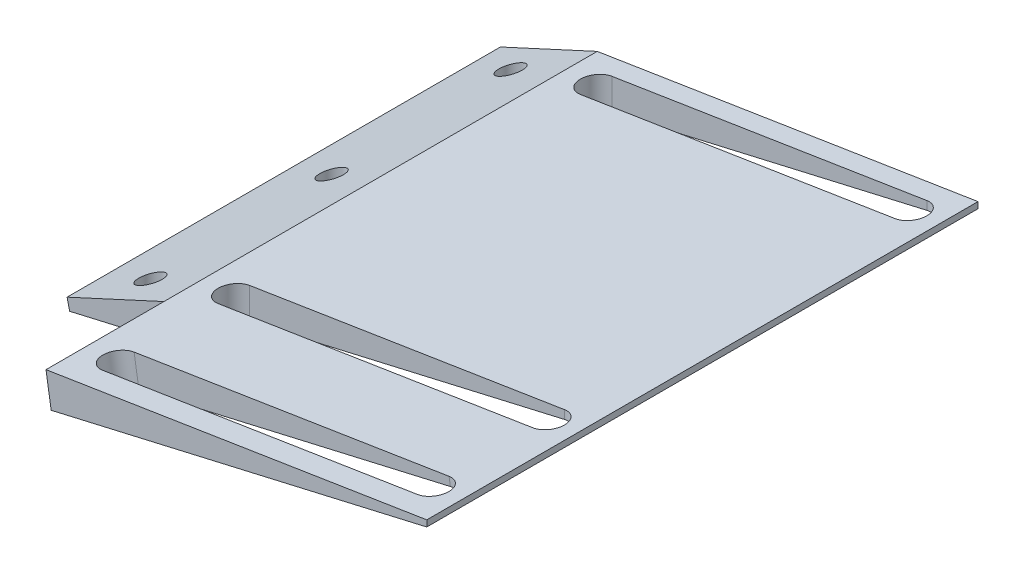
ISO-10303-21;
HEADER;
FILE_DESCRIPTION(('STEP AP214'),'2;1');
FILE_NAME('part.step','',(''),(''),'','','');
FILE_SCHEMA(('AUTOMOTIVE_DESIGN { 1 0 10303 214 1 1 1 1 }'));
ENDSEC;
DATA;
#1=APPLICATION_CONTEXT('core data for automotive mechanical design processes');
#2=APPLICATION_PROTOCOL_DEFINITION('international standard','automotive_design',2000,#1);
#3=PRODUCT_CONTEXT('',#1,'mechanical');
#4=PRODUCT('Part','Part','',(#3));
#5=PRODUCT_RELATED_PRODUCT_CATEGORY('part','',(#4));
#6=PRODUCT_DEFINITION_FORMATION('','',#4);
#7=PRODUCT_DEFINITION_CONTEXT('part definition',#1,'design');
#8=PRODUCT_DEFINITION('design','',#6,#7);
#9=PRODUCT_DEFINITION_SHAPE('','',#8);
#10=(LENGTH_UNIT() NAMED_UNIT(*) SI_UNIT(.MILLI.,.METRE.));
#11=(NAMED_UNIT(*) PLANE_ANGLE_UNIT() SI_UNIT($,.RADIAN.));
#12=(NAMED_UNIT(*) SI_UNIT($,.STERADIAN.) SOLID_ANGLE_UNIT());
#13=UNCERTAINTY_MEASURE_WITH_UNIT(LENGTH_MEASURE(1.E-05),#10,'distance_accuracy_value','');
#14=(GEOMETRIC_REPRESENTATION_CONTEXT(3) GLOBAL_UNCERTAINTY_ASSIGNED_CONTEXT((#13)) GLOBAL_UNIT_ASSIGNED_CONTEXT((#10,
#11,#12)) REPRESENTATION_CONTEXT('',''));
#15=CARTESIAN_POINT('',(0.,0.,0.));
#16=DIRECTION('',(0.,0.,1.));
#17=DIRECTION('',(1.,0.,0.));
#18=AXIS2_PLACEMENT_3D('',#15,#16,#17);
#19=CARTESIAN_POINT('',(0.,0.,110.));
#20=DIRECTION('',(0.156434465040224,-0.987688340595139,0.));
#21=DIRECTION('',(0.987688340595139,0.156434465040224,0.));
#22=AXIS2_PLACEMENT_3D('',#19,#20,#21);
#23=PLANE('',#22);
#24=DIRECTION('',(0.987688340595139,0.156434465040224,0.));
#25=VECTOR('',#24,1.);
#26=CARTESIAN_POINT('',(0.,0.,126.324079107667));
#27=LINE('',#26,#25);
#28=CARTESIAN_POINT('',(-109.820404962566,-17.3938433762093,126.324079107667));
#29=VERTEX_POINT('',#28);
#30=CARTESIAN_POINT('',(-29.8204049625664,-4.72308815024691,126.324079107667));
#31=VERTEX_POINT('',#30);
#32=EDGE_CURVE('E177',#29,#31,#27,.T.);
#33=ORIENTED_EDGE('',*,*,#32,.T.);
#34=CARTESIAN_POINT('',(-29.8204049625664,-4.72308815024691,130.324079107667));
#35=DIRECTION('',(0.156434465040224,-0.987688340595139,0.));
#36=DIRECTION('',(0.987688340595139,0.156434465040224,0.));
#37=AXIS2_PLACEMENT_3D('',#34,#35,#36);
#38=CIRCLE('',#37,4.);
#39=CARTESIAN_POINT('',(-29.8204049625664,-4.72308815024691,134.324079107667));
#40=VERTEX_POINT('',#39);
#41=EDGE_CURVE('E215',#31,#40,#38,.T.);
#42=ORIENTED_EDGE('',*,*,#41,.T.);
#43=DIRECTION('',(-0.987688340595139,-0.156434465040224,0.));
#44=VECTOR('',#43,1.);
#45=CARTESIAN_POINT('',(0.,0.,134.324079107667));
#46=LINE('',#45,#44);
#47=CARTESIAN_POINT('',(-109.820404962566,-17.3938433762093,134.324079107667));
#48=VERTEX_POINT('',#47);
#49=EDGE_CURVE('E211',#40,#48,#46,.T.);
#50=ORIENTED_EDGE('',*,*,#49,.T.);
#51=CARTESIAN_POINT('',(-109.820404962566,-17.3938433762093,130.324079107667));
#52=DIRECTION('',(0.156434465040224,-0.987688340595139,0.));
#53=DIRECTION('',(0.987688340595139,0.156434465040224,0.));
#54=AXIS2_PLACEMENT_3D('',#51,#52,#53);
#55=CIRCLE('',#54,4.00000000000002);
#56=EDGE_CURVE('E207',#48,#29,#55,.T.);
#57=ORIENTED_EDGE('',*,*,#56,.T.);
#58=EDGE_LOOP('',(#33,#42,#50,#57));
#59=FACE_BOUND('',#58,.T.);
#60=DIRECTION('',(0.987688340595139,0.156434465040224,0.));
#61=VECTOR('',#60,1.);
#62=CARTESIAN_POINT('',(0.,0.,5.00000000000002));
#63=LINE('',#62,#61);
#64=CARTESIAN_POINT('',(-109.820404962566,-17.3938433762093,4.99999999999998));
#65=VERTEX_POINT('',#64);
#66=CARTESIAN_POINT('',(-29.8204049625664,-4.72308815024691,5.00000000000001));
#67=VERTEX_POINT('',#66);
#68=EDGE_CURVE('E290',#65,#67,#63,.T.);
#69=ORIENTED_EDGE('',*,*,#68,.T.);
#70=CARTESIAN_POINT('',(-29.8204049625664,-4.7230881502469,8.99999999999998));
#71=DIRECTION('',(0.156434465040224,-0.987688340595139,0.));
#72=DIRECTION('',(0.987688340595139,0.156434465040224,0.));
#73=AXIS2_PLACEMENT_3D('',#70,#71,#72);
#74=ELLIPSE('',#73,4.049860503152,3.99999999999999);
#75=CARTESIAN_POINT('',(-29.8204049625664,-4.72308815024691,13.));
#76=VERTEX_POINT('',#75);
#77=EDGE_CURVE('E302',#67,#76,#74,.T.);
#78=ORIENTED_EDGE('',*,*,#77,.T.);
#79=DIRECTION('',(-0.987688340595139,-0.156434465040224,0.));
#80=VECTOR('',#79,1.);
#81=CARTESIAN_POINT('',(0.,0.,13.));
#82=LINE('',#81,#80);
#83=CARTESIAN_POINT('',(-109.820404962566,-17.3938433762093,13.));
#84=VERTEX_POINT('',#83);
#85=EDGE_CURVE('E298',#76,#84,#82,.T.);
#86=ORIENTED_EDGE('',*,*,#85,.T.);
#87=CARTESIAN_POINT('',(-109.820404962566,-17.3938433762093,8.99999999999997));
#88=DIRECTION('',(0.156434465040224,-0.987688340595139,0.));
#89=DIRECTION('',(0.987688340595139,0.156434465040224,0.));
#90=AXIS2_PLACEMENT_3D('',#87,#88,#89);
#91=ELLIPSE('',#90,4.04986050315203,4.00000000000003);
#92=EDGE_CURVE('E294',#84,#65,#91,.T.);
#93=ORIENTED_EDGE('',*,*,#92,.T.);
#94=EDGE_LOOP('',(#69,#78,#86,#93));
#95=FACE_BOUND('',#94,.T.);
#96=DIRECTION('',(0.987688340595139,0.156434465040224,0.));
#97=VECTOR('',#96,1.);
#98=CARTESIAN_POINT('',(0.,0.,97.));
#99=LINE('',#98,#97);
#100=CARTESIAN_POINT('',(-109.820404962566,-17.3938433762093,97.));
#101=VERTEX_POINT('',#100);
#102=CARTESIAN_POINT('',(-29.8204049625664,-4.72308815024691,97.));
#103=VERTEX_POINT('',#102);
#104=EDGE_CURVE('E274',#101,#103,#99,.T.);
#105=ORIENTED_EDGE('',*,*,#104,.T.);
#106=CARTESIAN_POINT('',(-29.8204049625664,-4.7230881502469,101.));
#107=DIRECTION('',(0.156434465040224,-0.987688340595139,0.));
#108=DIRECTION('',(0.987688340595139,0.156434465040224,0.));
#109=AXIS2_PLACEMENT_3D('',#106,#107,#108);
#110=ELLIPSE('',#109,4.049860503152,3.99999999999999);
#111=CARTESIAN_POINT('',(-29.8204049625664,-4.72308815024691,105.));
#112=VERTEX_POINT('',#111);
#113=EDGE_CURVE('E286',#103,#112,#110,.T.);
#114=ORIENTED_EDGE('',*,*,#113,.T.);
#115=DIRECTION('',(-0.987688340595139,-0.156434465040224,0.));
#116=VECTOR('',#115,1.);
#117=CARTESIAN_POINT('',(0.,0.,105.));
#118=LINE('',#117,#116);
#119=CARTESIAN_POINT('',(-109.820404962566,-17.3938433762093,105.));
#120=VERTEX_POINT('',#119);
#121=EDGE_CURVE('E282',#112,#120,#118,.T.);
#122=ORIENTED_EDGE('',*,*,#121,.T.);
#123=CARTESIAN_POINT('',(-109.820404962566,-17.3938433762093,101.));
#124=DIRECTION('',(0.156434465040224,-0.987688340595139,0.));
#125=DIRECTION('',(0.987688340595139,0.156434465040224,0.));
#126=AXIS2_PLACEMENT_3D('',#123,#124,#125);
#127=ELLIPSE('',#126,4.04986050315204,4.00000000000003);
#128=EDGE_CURVE('E278',#120,#101,#127,.T.);
#129=ORIENTED_EDGE('',*,*,#128,.T.);
#130=EDGE_LOOP('',(#105,#114,#122,#129));
#131=FACE_BOUND('',#130,.T.);
#132=DIRECTION('',(0.,0.,1.));
#133=VECTOR('',#132,1.);
#134=CARTESIAN_POINT('',(-21.8204049625664,-3.45601262765067,0.));
#135=LINE('',#134,#133);
#136=CARTESIAN_POINT('',(-21.8204049625664,-3.45601262765067,0.));
#137=VERTEX_POINT('',#136);
#138=CARTESIAN_POINT('',(-21.8204049625664,-3.45601262765067,140.));
#139=VERTEX_POINT('',#138);
#140=EDGE_CURVE('E310',#137,#139,#135,.T.);
#141=ORIENTED_EDGE('',*,*,#140,.F.);
#142=DIRECTION('',(-0.987688340595139,-0.156434465040224,0.));
#143=VECTOR('',#142,1.);
#144=CARTESIAN_POINT('',(0.,0.,0.));
#145=LINE('',#144,#143);
#146=CARTESIAN_POINT('',(-118.522600871417,-18.7721358048269,0.));
#147=VERTEX_POINT('',#146);
#148=EDGE_CURVE('E313',#137,#147,#145,.T.);
#149=ORIENTED_EDGE('',*,*,#148,.T.);
#150=DIRECTION('',(0.,0.,-1.));
#151=VECTOR('',#150,1.);
#152=CARTESIAN_POINT('',(-118.522600871417,-18.7721358048269,110.));
#153=LINE('',#152,#151);
#154=CARTESIAN_POINT('',(-118.522600871417,-18.7721358048269,110.045443527415));
#155=VERTEX_POINT('',#154);
#156=EDGE_CURVE('E337',#155,#147,#153,.T.);
#157=ORIENTED_EDGE('',*,*,#156,.F.);
#158=CARTESIAN_POINT('',(-118.522600871417,-18.7721358048269,140.));
#159=VERTEX_POINT('',#158);
#160=EDGE_CURVE('E185',#159,#155,#153,.T.);
#161=ORIENTED_EDGE('',*,*,#160,.F.);
#162=DIRECTION('',(-0.987688340595139,-0.156434465040224,0.));
#163=VECTOR('',#162,1.);
#164=CARTESIAN_POINT('',(-21.8204049625664,-3.45601262765067,140.));
#165=LINE('',#164,#163);
#166=EDGE_CURVE('E225',#139,#159,#165,.T.);
#167=ORIENTED_EDGE('',*,*,#166,.F.);
#168=EDGE_LOOP('',(#141,#149,#157,#161,#167));
#169=FACE_BOUND('',#168,.T.);
#170=ADVANCED_FACE('F39',(#59,#95,#131,#169),#23,.F.);
#171=CARTESIAN_POINT('',(0.,0.,110.));
#172=DIRECTION('',(-0.224951054343859,0.974370064785237,0.));
#173=DIRECTION('',(-0.974370064785237,-0.224951054343859,0.));
#174=AXIS2_PLACEMENT_3D('',#171,#172,#173);
#175=PLANE('',#174);
#176=DIRECTION('',(0.974370064785237,0.224951054343859,0.));
#177=VECTOR('',#176,1.);
#178=CARTESIAN_POINT('',(0.,0.,134.324079107667));
#179=LINE('',#178,#177);
#180=CARTESIAN_POINT('',(-108.604108947823,-25.0732341815868,134.324079107667));
#181=VERTEX_POINT('',#180);
#182=CARTESIAN_POINT('',(-29.4901344656915,-6.80833400014363,134.324079107667));
#183=VERTEX_POINT('',#182);
#184=EDGE_CURVE('E47',#181,#183,#179,.T.);
#185=ORIENTED_EDGE('',*,*,#184,.T.);
#186=CARTESIAN_POINT('',(-29.4901344656915,-6.80833400014362,130.324079107667));
#187=DIRECTION('',(-0.224951054343859,0.974370064785237,0.));
#188=DIRECTION('',(0.974370064785237,0.224951054343859,0.));
#189=AXIS2_PLACEMENT_3D('',#186,#187,#188);
#190=ELLIPSE('',#189,4.00976759232469,4.);
#191=CARTESIAN_POINT('',(-29.4901344656915,-6.80833400014363,126.324079107667));
#192=VERTEX_POINT('',#191);
#193=EDGE_CURVE('E11',#183,#192,#190,.T.);
#194=ORIENTED_EDGE('',*,*,#193,.T.);
#195=DIRECTION('',(-0.974370064785237,-0.224951054343859,0.));
#196=VECTOR('',#195,1.);
#197=CARTESIAN_POINT('',(0.,0.,126.324079107667));
#198=LINE('',#197,#196);
#199=CARTESIAN_POINT('',(-108.604108947823,-25.0732341815868,126.324079107667));
#200=VERTEX_POINT('',#199);
#201=EDGE_CURVE('E386',#192,#200,#198,.T.);
#202=ORIENTED_EDGE('',*,*,#201,.T.);
#203=CARTESIAN_POINT('',(-108.604108947823,-25.0732341815868,130.324079107667));
#204=DIRECTION('',(-0.224951054343859,0.974370064785237,0.));
#205=DIRECTION('',(0.974370064785237,0.224951054343859,0.));
#206=AXIS2_PLACEMENT_3D('',#203,#204,#205);
#207=ELLIPSE('',#206,4.00976759232471,4.00000000000002);
#208=EDGE_CURVE('E390',#200,#181,#207,.T.);
#209=ORIENTED_EDGE('',*,*,#208,.T.);
#210=EDGE_LOOP('',(#185,#194,#202,#209));
#211=FACE_BOUND('',#210,.T.);
#212=DIRECTION('',(0.974370064785237,0.224951054343859,0.));
#213=VECTOR('',#212,1.);
#214=CARTESIAN_POINT('',(0.,0.,13.));
#215=LINE('',#214,#213);
#216=CARTESIAN_POINT('',(-109.820404962566,-25.3540382423838,13.));
#217=VERTEX_POINT('',#216);
#218=CARTESIAN_POINT('',(-29.8204049625664,-6.88458295233928,13.));
#219=VERTEX_POINT('',#218);
#220=EDGE_CURVE('E373',#217,#219,#215,.T.);
#221=ORIENTED_EDGE('',*,*,#220,.T.);
#222=CARTESIAN_POINT('',(-29.8204049625664,-6.88458295233927,8.99999999999998));
#223=DIRECTION('',(-0.224951054343859,0.974370064785237,0.));
#224=DIRECTION('',(0.974370064785237,0.224951054343859,0.));
#225=AXIS2_PLACEMENT_3D('',#222,#223,#224);
#226=ELLIPSE('',#225,4.10521643117355,3.99999999999999);
#227=CARTESIAN_POINT('',(-29.8204049625664,-6.88458295233928,5.00000000000001));
#228=VERTEX_POINT('',#227);
#229=EDGE_CURVE('E377',#219,#228,#226,.T.);
#230=ORIENTED_EDGE('',*,*,#229,.T.);
#231=DIRECTION('',(-0.974370064785237,-0.224951054343859,0.));
#232=VECTOR('',#231,1.);
#233=CARTESIAN_POINT('',(0.,0.,5.00000000000002));
#234=LINE('',#233,#232);
#235=CARTESIAN_POINT('',(-109.820404962566,-25.3540382423838,4.99999999999998));
#236=VERTEX_POINT('',#235);
#237=EDGE_CURVE('E365',#228,#236,#234,.T.);
#238=ORIENTED_EDGE('',*,*,#237,.T.);
#239=CARTESIAN_POINT('',(-109.820404962566,-25.3540382423838,8.99999999999997));
#240=DIRECTION('',(-0.224951054343859,0.974370064785237,0.));
#241=DIRECTION('',(0.974370064785237,0.224951054343859,0.));
#242=AXIS2_PLACEMENT_3D('',#239,#240,#241);
#243=ELLIPSE('',#242,4.10521643117359,4.00000000000003);
#244=EDGE_CURVE('E369',#236,#217,#243,.T.);
#245=ORIENTED_EDGE('',*,*,#244,.T.);
#246=EDGE_LOOP('',(#221,#230,#238,#245));
#247=FACE_BOUND('',#246,.T.);
#248=CARTESIAN_POINT('',(-130.995623221144,-30.2427225784305,101.));
#249=DIRECTION('',(-0.224951054343859,0.974370064785237,0.));
#250=DIRECTION('',(0.974370064785237,0.224951054343859,0.));
#251=AXIS2_PLACEMENT_3D('',#248,#249,#250);
#252=ELLIPSE('',#251,3.07891232338016,2.99999999999999);
#253=CARTESIAN_POINT('',(-127.995623221144,-29.5501180050538,101.));
#254=VERTEX_POINT('',#253);
#255=EDGE_CURVE('E270',#254,#254,#252,.T.);
#256=ORIENTED_EDGE('',*,*,#255,.T.);
#257=EDGE_LOOP('',(#256));
#258=FACE_BOUND('',#257,.T.);
#259=CARTESIAN_POINT('',(-131.538244407152,-30.3679965501105,8.99999999999997));
#260=DIRECTION('',(-0.224951054343859,0.974370064785237,0.));
#261=DIRECTION('',(0.974370064785237,0.224951054343859,0.));
#262=AXIS2_PLACEMENT_3D('',#259,#260,#261);
#263=ELLIPSE('',#262,3.07891232338016,2.99999999999999);
#264=CARTESIAN_POINT('',(-128.538244407152,-29.6753919767338,8.99999999999997));
#265=VERTEX_POINT('',#264);
#266=EDGE_CURVE('E265',#265,#265,#263,.T.);
#267=ORIENTED_EDGE('',*,*,#266,.T.);
#268=EDGE_LOOP('',(#267));
#269=FACE_BOUND('',#268,.T.);
#270=CARTESIAN_POINT('',(-130.995623221142,-30.2427225784299,55.));
#271=DIRECTION('',(-0.224951054343859,0.974370064785237,0.));
#272=DIRECTION('',(0.974370064785237,0.224951054343859,0.));
#273=AXIS2_PLACEMENT_3D('',#270,#271,#272);
#274=ELLIPSE('',#273,3.07891232338016,2.99999999999999);
#275=CARTESIAN_POINT('',(-127.995623221142,-29.5501180050532,55.));
#276=VERTEX_POINT('',#275);
#277=EDGE_CURVE('E260',#276,#276,#274,.T.);
#278=ORIENTED_EDGE('',*,*,#277,.T.);
#279=EDGE_LOOP('',(#278));
#280=FACE_BOUND('',#279,.T.);
#281=DIRECTION('',(0.974370064785237,0.224951054343859,0.));
#282=VECTOR('',#281,1.);
#283=CARTESIAN_POINT('',(0.,0.,105.));
#284=LINE('',#283,#282);
#285=CARTESIAN_POINT('',(-109.820404962566,-25.3540382423838,105.));
#286=VERTEX_POINT('',#285);
#287=CARTESIAN_POINT('',(-29.8204049625664,-6.88458295233928,105.));
#288=VERTEX_POINT('',#287);
#289=EDGE_CURVE('E357',#286,#288,#284,.T.);
#290=ORIENTED_EDGE('',*,*,#289,.T.);
#291=CARTESIAN_POINT('',(-29.8204049625664,-6.88458295233927,101.));
#292=DIRECTION('',(-0.224951054343859,0.974370064785237,0.));
#293=DIRECTION('',(0.974370064785237,0.224951054343859,0.));
#294=AXIS2_PLACEMENT_3D('',#291,#292,#293);
#295=ELLIPSE('',#294,4.10521643117355,3.99999999999999);
#296=CARTESIAN_POINT('',(-29.8204049625664,-6.88458295233928,97.));
#297=VERTEX_POINT('',#296);
#298=EDGE_CURVE('E361',#288,#297,#295,.T.);
#299=ORIENTED_EDGE('',*,*,#298,.T.);
#300=DIRECTION('',(-0.974370064785237,-0.224951054343859,0.));
#301=VECTOR('',#300,1.);
#302=CARTESIAN_POINT('',(0.,0.,97.));
#303=LINE('',#302,#301);
#304=CARTESIAN_POINT('',(-109.820404962566,-25.3540382423838,97.));
#305=VERTEX_POINT('',#304);
#306=EDGE_CURVE('E340',#297,#305,#303,.T.);
#307=ORIENTED_EDGE('',*,*,#306,.T.);
#308=CARTESIAN_POINT('',(-109.820404962566,-25.3540382423838,101.));
#309=DIRECTION('',(-0.224951054343859,0.974370064785237,0.));
#310=DIRECTION('',(0.974370064785237,0.224951054343859,0.));
#311=AXIS2_PLACEMENT_3D('',#308,#309,#310);
#312=ELLIPSE('',#311,4.10521643117359,4.00000000000003);
#313=EDGE_CURVE('E353',#305,#286,#312,.T.);
#314=ORIENTED_EDGE('',*,*,#313,.T.);
#315=EDGE_LOOP('',(#290,#299,#307,#314));
#316=FACE_BOUND('',#315,.T.);
#317=DIRECTION('',(0.974370064785237,0.224951054343859,0.));
#318=VECTOR('',#317,1.);
#319=CARTESIAN_POINT('',(-142.475314214893,-32.8930180728377,140.));
#320=LINE('',#319,#318);
#321=CARTESIAN_POINT('',(-117.209925261215,-27.0600434270182,140.));
#322=VERTEX_POINT('',#321);
#323=CARTESIAN_POINT('',(-21.8204049625664,-5.03763742333482,140.));
#324=VERTEX_POINT('',#323);
#325=EDGE_CURVE('E191',#322,#324,#320,.T.);
#326=ORIENTED_EDGE('',*,*,#325,.F.);
#327=DIRECTION('',(0.,0.,-1.));
#328=VECTOR('',#327,1.);
#329=CARTESIAN_POINT('',(-117.209925261215,-27.0600434270182,110.));
#330=LINE('',#329,#328);
#331=CARTESIAN_POINT('',(-117.209925261215,-27.0600434270182,110.045443527415));
#332=VERTEX_POINT('',#331);
#333=EDGE_CURVE('E182',#322,#332,#330,.T.);
#334=ORIENTED_EDGE('',*,*,#333,.T.);
#335=DIRECTION('',(-0.974370064785237,-0.224951054343859,0.));
#336=VECTOR('',#335,1.);
#337=CARTESIAN_POINT('',(0.,0.,110.045443527415));
#338=LINE('',#337,#336);
#339=CARTESIAN_POINT('',(-142.475314214893,-32.8930180728377,110.045443527415));
#340=VERTEX_POINT('',#339);
#341=EDGE_CURVE('E166',#332,#340,#338,.T.);
#342=ORIENTED_EDGE('',*,*,#341,.T.);
#343=DIRECTION('',(0.,0.,-1.));
#344=VECTOR('',#343,1.);
#345=CARTESIAN_POINT('',(-142.475314214893,-32.8930180728377,110.));
#346=LINE('',#345,#344);
#347=CARTESIAN_POINT('',(-142.475314214893,-32.8930180728377,0.));
#348=VERTEX_POINT('',#347);
#349=EDGE_CURVE('E331',#340,#348,#346,.T.);
#350=ORIENTED_EDGE('',*,*,#349,.T.);
#351=DIRECTION('',(0.974370064785237,0.224951054343859,0.));
#352=VECTOR('',#351,1.);
#353=CARTESIAN_POINT('',(0.,0.,0.));
#354=LINE('',#353,#352);
#355=CARTESIAN_POINT('',(-21.8204049625664,-5.03763742333482,0.));
#356=VERTEX_POINT('',#355);
#357=EDGE_CURVE('E327',#348,#356,#354,.T.);
#358=ORIENTED_EDGE('',*,*,#357,.T.);
#359=DIRECTION('',(0.,0.,1.));
#360=VECTOR('',#359,1.);
#361=CARTESIAN_POINT('',(-21.8204049625664,-5.03763742333482,0.));
#362=LINE('',#361,#360);
#363=EDGE_CURVE('E309',#356,#324,#362,.T.);
#364=ORIENTED_EDGE('',*,*,#363,.T.);
#365=EDGE_LOOP('',(#326,#334,#342,#350,#358,#364));
#366=FACE_BOUND('',#365,.T.);
#367=ADVANCED_FACE('F189',(#211,#247,#258,#269,#280,#316,#366),#175,.F.);
#368=CARTESIAN_POINT('',(0.,0.,0.));
#369=DIRECTION('',(0.,0.,1.));
#370=DIRECTION('',(1.,0.,0.));
#371=AXIS2_PLACEMENT_3D('',#368,#369,#370);
#372=PLANE('',#371);
#373=DIRECTION('',(0.,1.,0.));
#374=VECTOR('',#373,1.);
#375=CARTESIAN_POINT('',(-21.8204049625664,0.,0.));
#376=LINE('',#375,#374);
#377=EDGE_CURVE('E306',#356,#137,#376,.T.);
#378=ORIENTED_EDGE('',*,*,#377,.F.);
#379=ORIENTED_EDGE('',*,*,#357,.F.);
#380=DIRECTION('',(0.224951054343858,-0.974370064785237,0.));
#381=VECTOR('',#380,1.);
#382=CARTESIAN_POINT('',(-143.119166496515,-30.104187448393,0.));
#383=LINE('',#382,#381);
#384=CARTESIAN_POINT('',(-143.119166496515,-30.104187448393,0.));
#385=VERTEX_POINT('',#384);
#386=EDGE_CURVE('E323',#385,#348,#383,.T.);
#387=ORIENTED_EDGE('',*,*,#386,.F.);
#388=DIRECTION('',(-0.908243113161488,-0.418442884268245,0.));
#389=VECTOR('',#388,1.);
#390=CARTESIAN_POINT('',(-118.522600871417,-18.7721358048269,0.));
#391=LINE('',#390,#389);
#392=EDGE_CURVE('E319',#147,#385,#391,.T.);
#393=ORIENTED_EDGE('',*,*,#392,.F.);
#394=ORIENTED_EDGE('',*,*,#148,.F.);
#395=EDGE_LOOP('',(#378,#379,#387,#393,#394));
#396=FACE_BOUND('',#395,.T.);
#397=ADVANCED_FACE('F426',(#396),#372,.F.);
#398=CARTESIAN_POINT('',(-118.522600871417,-18.7721358048269,110.));
#399=DIRECTION('',(0.418442884268245,-0.908243113161488,0.));
#400=DIRECTION('',(0.908243113161488,0.418442884268245,0.));
#401=AXIS2_PLACEMENT_3D('',#398,#399,#400);
#402=PLANE('',#401);
#403=CARTESIAN_POINT('',(-130.995623221144,-24.5186670715433,101.));
#404=DIRECTION('',(0.418442884268245,-0.908243113161488,0.));
#405=DIRECTION('',(0.908243113161488,0.418442884268245,0.));
#406=AXIS2_PLACEMENT_3D('',#403,#404,#405);
#407=ELLIPSE('',#406,3.30308037190323,2.99999999999999);
#408=CARTESIAN_POINT('',(-127.995623221144,-23.1365165937543,101.));
#409=VERTEX_POINT('',#408);
#410=EDGE_CURVE('E269',#409,#409,#407,.T.);
#411=ORIENTED_EDGE('',*,*,#410,.T.);
#412=EDGE_LOOP('',(#411));
#413=FACE_BOUND('',#412,.T.);
#414=CARTESIAN_POINT('',(-131.538244407152,-24.768661782043,8.99999999999997));
#415=DIRECTION('',(0.418442884268245,-0.908243113161488,0.));
#416=DIRECTION('',(0.908243113161488,0.418442884268245,0.));
#417=AXIS2_PLACEMENT_3D('',#414,#415,#416);
#418=ELLIPSE('',#417,3.30308037190323,2.99999999999999);
#419=CARTESIAN_POINT('',(-128.538244407152,-23.386511304254,8.99999999999997));
#420=VERTEX_POINT('',#419);
#421=EDGE_CURVE('E264',#420,#420,#418,.T.);
#422=ORIENTED_EDGE('',*,*,#421,.T.);
#423=EDGE_LOOP('',(#422));
#424=FACE_BOUND('',#423,.T.);
#425=CARTESIAN_POINT('',(-130.995623221142,-24.5186670715421,55.));
#426=DIRECTION('',(0.418442884268245,-0.908243113161488,0.));
#427=DIRECTION('',(0.908243113161488,0.418442884268245,0.));
#428=AXIS2_PLACEMENT_3D('',#425,#426,#427);
#429=ELLIPSE('',#428,3.30308037190323,2.99999999999999);
#430=CARTESIAN_POINT('',(-127.995623221142,-23.1365165937531,55.));
#431=VERTEX_POINT('',#430);
#432=EDGE_CURVE('E249',#431,#431,#429,.T.);
#433=ORIENTED_EDGE('',*,*,#432,.T.);
#434=EDGE_LOOP('',(#433));
#435=FACE_BOUND('',#434,.T.);
#436=DIRECTION('',(0.,0.,-1.));
#437=VECTOR('',#436,1.);
#438=CARTESIAN_POINT('',(-143.119166496515,-30.104187448393,110.));
#439=LINE('',#438,#437);
#440=CARTESIAN_POINT('',(-143.119166496515,-30.104187448393,110.045443527415));
#441=VERTEX_POINT('',#440);
#442=EDGE_CURVE('E334',#441,#385,#439,.T.);
#443=ORIENTED_EDGE('',*,*,#442,.F.);
#444=DIRECTION('',(0.908243113161488,0.418442884268245,0.));
#445=VECTOR('',#444,1.);
#446=CARTESIAN_POINT('',(-118.522600871417,-18.7721358048269,110.045443527415));
#447=LINE('',#446,#445);
#448=EDGE_CURVE('E178',#441,#155,#447,.T.);
#449=ORIENTED_EDGE('',*,*,#448,.T.);
#450=ORIENTED_EDGE('',*,*,#156,.T.);
#451=ORIENTED_EDGE('',*,*,#392,.T.);
#452=EDGE_LOOP('',(#443,#449,#450,#451));
#453=FACE_BOUND('',#452,.T.);
#454=ADVANCED_FACE('F431',(#413,#424,#435,#453),#402,.F.);
#455=CARTESIAN_POINT('',(-143.119166496515,-30.104187448393,110.));
#456=DIRECTION('',(0.974370064785237,0.224951054343858,0.));
#457=DIRECTION('',(-0.224951054343858,0.974370064785237,0.));
#458=AXIS2_PLACEMENT_3D('',#455,#456,#457);
#459=PLANE('',#458);
#460=ORIENTED_EDGE('',*,*,#349,.F.);
#461=DIRECTION('',(-0.224951054343858,0.974370064785237,0.));
#462=VECTOR('',#461,1.);
#463=CARTESIAN_POINT('',(-143.119166496515,-30.104187448393,110.045443527415));
#464=LINE('',#463,#462);
#465=EDGE_CURVE('E172',#340,#441,#464,.T.);
#466=ORIENTED_EDGE('',*,*,#465,.T.);
#467=ORIENTED_EDGE('',*,*,#442,.T.);
#468=ORIENTED_EDGE('',*,*,#386,.T.);
#469=EDGE_LOOP('',(#460,#466,#467,#468));
#470=FACE_BOUND('',#469,.T.);
#471=ADVANCED_FACE('F436',(#470),#459,.F.);
#472=CARTESIAN_POINT('',(-21.8204049625664,0.,0.));
#473=DIRECTION('',(1.,0.,0.));
#474=DIRECTION('',(0.,1.,0.));
#475=AXIS2_PLACEMENT_3D('',#472,#473,#474);
#476=PLANE('',#475);
#477=ORIENTED_EDGE('',*,*,#363,.F.);
#478=ORIENTED_EDGE('',*,*,#377,.T.);
#479=ORIENTED_EDGE('',*,*,#140,.T.);
#480=DIRECTION('',(0.,1.,0.));
#481=VECTOR('',#480,1.);
#482=CARTESIAN_POINT('',(-21.8204049625664,-5.03763742333482,140.));
#483=LINE('',#482,#481);
#484=EDGE_CURVE('E221',#324,#139,#483,.T.);
#485=ORIENTED_EDGE('',*,*,#484,.F.);
#486=EDGE_LOOP('',(#477,#478,#479,#485));
#487=FACE_BOUND('',#486,.T.);
#488=ADVANCED_FACE('F438',(#487),#476,.T.);
#489=CARTESIAN_POINT('',(-130.995623221142,-32.8930180728377,55.));
#490=DIRECTION('',(0.,1.,0.));
#491=DIRECTION('',(0.,0.,1.));
#492=AXIS2_PLACEMENT_3D('',#489,#490,#491);
#493=CYLINDRICAL_SURFACE('',#492,2.99999999999999);
#494=ORIENTED_EDGE('',*,*,#432,.F.);
#495=EDGE_LOOP('',(#494));
#496=FACE_BOUND('',#495,.T.);
#497=ORIENTED_EDGE('',*,*,#277,.F.);
#498=EDGE_LOOP('',(#497));
#499=FACE_BOUND('',#498,.T.);
#500=ADVANCED_FACE('F479',(#496,#499),#493,.F.);
#501=CARTESIAN_POINT('',(-131.538244407152,-32.8930180728377,8.99999999999997));
#502=DIRECTION('',(0.,1.,0.));
#503=DIRECTION('',(0.,0.,1.));
#504=AXIS2_PLACEMENT_3D('',#501,#502,#503);
#505=CYLINDRICAL_SURFACE('',#504,2.99999999999999);
#506=ORIENTED_EDGE('',*,*,#421,.F.);
#507=EDGE_LOOP('',(#506));
#508=FACE_BOUND('',#507,.T.);
#509=ORIENTED_EDGE('',*,*,#266,.F.);
#510=EDGE_LOOP('',(#509));
#511=FACE_BOUND('',#510,.T.);
#512=ADVANCED_FACE('F475',(#508,#511),#505,.F.);
#513=CARTESIAN_POINT('',(-130.995623221144,-32.8930180728377,101.));
#514=DIRECTION('',(0.,1.,0.));
#515=DIRECTION('',(0.,0.,1.));
#516=AXIS2_PLACEMENT_3D('',#513,#514,#515);
#517=CYLINDRICAL_SURFACE('',#516,2.99999999999999);
#518=ORIENTED_EDGE('',*,*,#410,.F.);
#519=EDGE_LOOP('',(#518));
#520=FACE_BOUND('',#519,.T.);
#521=ORIENTED_EDGE('',*,*,#255,.F.);
#522=EDGE_LOOP('',(#521));
#523=FACE_BOUND('',#522,.T.);
#524=ADVANCED_FACE('F478',(#520,#523),#517,.F.);
#525=CARTESIAN_POINT('',(-29.8204049625664,-32.8930180728377,101.));
#526=DIRECTION('',(0.,1.,0.));
#527=DIRECTION('',(0.,0.,1.));
#528=AXIS2_PLACEMENT_3D('',#525,#526,#527);
#529=CYLINDRICAL_SURFACE('',#528,3.99999999999999);
#530=DIRECTION('',(0.,1.,0.));
#531=VECTOR('',#530,1.);
#532=CARTESIAN_POINT('',(-29.8204049625664,-32.8930180728377,97.));
#533=LINE('',#532,#531);
#534=EDGE_CURVE('E234',#297,#103,#533,.T.);
#535=ORIENTED_EDGE('',*,*,#534,.F.);
#536=ORIENTED_EDGE('',*,*,#298,.F.);
#537=DIRECTION('',(0.,1.,0.));
#538=VECTOR('',#537,1.);
#539=CARTESIAN_POINT('',(-29.8204049625664,-32.8930180728377,105.));
#540=LINE('',#539,#538);
#541=EDGE_CURVE('E245',#288,#112,#540,.T.);
#542=ORIENTED_EDGE('',*,*,#541,.T.);
#543=ORIENTED_EDGE('',*,*,#113,.F.);
#544=EDGE_LOOP('',(#535,#536,#542,#543));
#545=FACE_BOUND('',#544,.T.);
#546=ADVANCED_FACE('F498',(#545),#529,.F.);
#547=CARTESIAN_POINT('',(-29.8204049625664,-32.8930180728377,105.));
#548=DIRECTION('',(0.,0.,1.));
#549=DIRECTION('',(1.,0.,0.));
#550=AXIS2_PLACEMENT_3D('',#547,#548,#549);
#551=PLANE('',#550);
#552=ORIENTED_EDGE('',*,*,#541,.F.);
#553=ORIENTED_EDGE('',*,*,#289,.F.);
#554=DIRECTION('',(0.,1.,0.));
#555=VECTOR('',#554,1.);
#556=CARTESIAN_POINT('',(-109.820404962566,-32.8930180728377,105.));
#557=LINE('',#556,#555);
#558=EDGE_CURVE('E250',#286,#120,#557,.T.);
#559=ORIENTED_EDGE('',*,*,#558,.T.);
#560=ORIENTED_EDGE('',*,*,#121,.F.);
#561=EDGE_LOOP('',(#552,#553,#559,#560));
#562=FACE_BOUND('',#561,.T.);
#563=ADVANCED_FACE('F500',(#562),#551,.F.);
#564=CARTESIAN_POINT('',(-109.820404962566,-32.8930180728377,101.));
#565=DIRECTION('',(0.,1.,0.));
#566=DIRECTION('',(0.,0.,1.));
#567=AXIS2_PLACEMENT_3D('',#564,#565,#566);
#568=CYLINDRICAL_SURFACE('',#567,4.00000000000003);
#569=ORIENTED_EDGE('',*,*,#558,.F.);
#570=ORIENTED_EDGE('',*,*,#313,.F.);
#571=DIRECTION('',(0.,1.,0.));
#572=VECTOR('',#571,1.);
#573=CARTESIAN_POINT('',(-109.820404962566,-32.8930180728377,97.));
#574=LINE('',#573,#572);
#575=EDGE_CURVE('E254',#305,#101,#574,.T.);
#576=ORIENTED_EDGE('',*,*,#575,.T.);
#577=ORIENTED_EDGE('',*,*,#128,.F.);
#578=EDGE_LOOP('',(#569,#570,#576,#577));
#579=FACE_BOUND('',#578,.T.);
#580=ADVANCED_FACE('F503',(#579),#568,.F.);
#581=CARTESIAN_POINT('',(-29.8204049625664,-32.8930180728377,97.));
#582=DIRECTION('',(0.,0.,-1.));
#583=DIRECTION('',(-1.,0.,0.));
#584=AXIS2_PLACEMENT_3D('',#581,#582,#583);
#585=PLANE('',#584);
#586=ORIENTED_EDGE('',*,*,#575,.F.);
#587=ORIENTED_EDGE('',*,*,#306,.F.);
#588=ORIENTED_EDGE('',*,*,#534,.T.);
#589=ORIENTED_EDGE('',*,*,#104,.F.);
#590=EDGE_LOOP('',(#586,#587,#588,#589));
#591=FACE_BOUND('',#590,.T.);
#592=ADVANCED_FACE('F494',(#591),#585,.F.);
#593=CARTESIAN_POINT('',(-29.8204049625664,-32.8930180728377,8.99999999999998));
#594=DIRECTION('',(0.,1.,0.));
#595=DIRECTION('',(0.,0.,1.));
#596=AXIS2_PLACEMENT_3D('',#593,#594,#595);
#597=CYLINDRICAL_SURFACE('',#596,3.99999999999999);
#598=DIRECTION('',(0.,1.,0.));
#599=VECTOR('',#598,1.);
#600=CARTESIAN_POINT('',(-29.8204049625664,-32.8930180728377,5.));
#601=LINE('',#600,#599);
#602=EDGE_CURVE('E229',#228,#67,#601,.T.);
#603=ORIENTED_EDGE('',*,*,#602,.F.);
#604=ORIENTED_EDGE('',*,*,#229,.F.);
#605=DIRECTION('',(0.,1.,0.));
#606=VECTOR('',#605,1.);
#607=CARTESIAN_POINT('',(-29.8204049625664,-32.8930180728377,13.));
#608=LINE('',#607,#606);
#609=EDGE_CURVE('E230',#219,#76,#608,.T.);
#610=ORIENTED_EDGE('',*,*,#609,.T.);
#611=ORIENTED_EDGE('',*,*,#77,.F.);
#612=EDGE_LOOP('',(#603,#604,#610,#611));
#613=FACE_BOUND('',#612,.T.);
#614=ADVANCED_FACE('F487',(#613),#597,.F.);
#615=CARTESIAN_POINT('',(-29.8204049625664,-32.8930180728377,13.));
#616=DIRECTION('',(0.,0.,1.));
#617=DIRECTION('',(1.,0.,0.));
#618=AXIS2_PLACEMENT_3D('',#615,#616,#617);
#619=PLANE('',#618);
#620=ORIENTED_EDGE('',*,*,#609,.F.);
#621=ORIENTED_EDGE('',*,*,#220,.F.);
#622=DIRECTION('',(0.,1.,0.));
#623=VECTOR('',#622,1.);
#624=CARTESIAN_POINT('',(-109.820404962566,-32.8930180728377,13.));
#625=LINE('',#624,#623);
#626=EDGE_CURVE('E235',#217,#84,#625,.T.);
#627=ORIENTED_EDGE('',*,*,#626,.T.);
#628=ORIENTED_EDGE('',*,*,#85,.F.);
#629=EDGE_LOOP('',(#620,#621,#627,#628));
#630=FACE_BOUND('',#629,.T.);
#631=ADVANCED_FACE('F484',(#630),#619,.F.);
#632=CARTESIAN_POINT('',(-109.820404962566,-32.8930180728377,8.99999999999997));
#633=DIRECTION('',(0.,1.,0.));
#634=DIRECTION('',(0.,0.,1.));
#635=AXIS2_PLACEMENT_3D('',#632,#633,#634);
#636=CYLINDRICAL_SURFACE('',#635,4.00000000000003);
#637=ORIENTED_EDGE('',*,*,#626,.F.);
#638=ORIENTED_EDGE('',*,*,#244,.F.);
#639=DIRECTION('',(0.,1.,0.));
#640=VECTOR('',#639,1.);
#641=CARTESIAN_POINT('',(-109.820404962566,-32.8930180728377,4.99999999999998));
#642=LINE('',#641,#640);
#643=EDGE_CURVE('E239',#236,#65,#642,.T.);
#644=ORIENTED_EDGE('',*,*,#643,.T.);
#645=ORIENTED_EDGE('',*,*,#92,.F.);
#646=EDGE_LOOP('',(#637,#638,#644,#645));
#647=FACE_BOUND('',#646,.T.);
#648=ADVANCED_FACE('F471',(#647),#636,.F.);
#649=CARTESIAN_POINT('',(-29.8204049625664,-32.8930180728377,5.));
#650=DIRECTION('',(0.,0.,-1.));
#651=DIRECTION('',(-1.,0.,0.));
#652=AXIS2_PLACEMENT_3D('',#649,#650,#651);
#653=PLANE('',#652);
#654=ORIENTED_EDGE('',*,*,#643,.F.);
#655=ORIENTED_EDGE('',*,*,#237,.F.);
#656=ORIENTED_EDGE('',*,*,#602,.T.);
#657=ORIENTED_EDGE('',*,*,#68,.F.);
#658=EDGE_LOOP('',(#654,#655,#656,#657));
#659=FACE_BOUND('',#658,.T.);
#660=ADVANCED_FACE('F465',(#659),#653,.F.);
#661=CARTESIAN_POINT('',(0.,0.,140.));
#662=DIRECTION('',(0.,0.,1.));
#663=DIRECTION('',(1.,0.,0.));
#664=AXIS2_PLACEMENT_3D('',#661,#662,#663);
#665=PLANE('',#664);
#666=DIRECTION('',(-0.156434465040224,0.987688340595139,0.));
#667=VECTOR('',#666,1.);
#668=CARTESIAN_POINT('',(-118.522600871417,-18.7721358048269,140.));
#669=LINE('',#668,#667);
#670=EDGE_CURVE('E381',#322,#159,#669,.T.);
#671=ORIENTED_EDGE('',*,*,#670,.F.);
#672=ORIENTED_EDGE('',*,*,#325,.T.);
#673=ORIENTED_EDGE('',*,*,#484,.T.);
#674=ORIENTED_EDGE('',*,*,#166,.T.);
#675=EDGE_LOOP('',(#671,#672,#673,#674));
#676=FACE_BOUND('',#675,.T.);
#677=ADVANCED_FACE('F463',(#676),#665,.T.);
#678=CARTESIAN_POINT('',(-113.974333398382,-47.488766451851,110.045443527415));
#679=DIRECTION('',(0.,0.,-1.));
#680=DIRECTION('',(-1.,0.,0.));
#681=AXIS2_PLACEMENT_3D('',#678,#679,#680);
#682=PLANE('',#681);
#683=DIRECTION('',(-0.156434465040224,0.987688340595139,0.));
#684=VECTOR('',#683,1.);
#685=CARTESIAN_POINT('',(-113.974333398382,-47.488766451851,110.045443527415));
#686=LINE('',#685,#684);
#687=EDGE_CURVE('E169',#332,#155,#686,.T.);
#688=ORIENTED_EDGE('',*,*,#687,.T.);
#689=ORIENTED_EDGE('',*,*,#448,.F.);
#690=ORIENTED_EDGE('',*,*,#465,.F.);
#691=ORIENTED_EDGE('',*,*,#341,.F.);
#692=EDGE_LOOP('',(#688,#689,#690,#691));
#693=FACE_BOUND('',#692,.T.);
#694=ADVANCED_FACE('F168',(#693),#682,.F.);
#695=CARTESIAN_POINT('',(-113.974333398382,-47.488766451851,140.));
#696=DIRECTION('',(0.987688340595139,0.156434465040224,0.));
#697=DIRECTION('',(-0.156434465040224,0.987688340595139,0.));
#698=AXIS2_PLACEMENT_3D('',#695,#696,#697);
#699=PLANE('',#698);
#700=ORIENTED_EDGE('',*,*,#670,.T.);
#701=ORIENTED_EDGE('',*,*,#160,.T.);
#702=ORIENTED_EDGE('',*,*,#687,.F.);
#703=ORIENTED_EDGE('',*,*,#333,.F.);
#704=EDGE_LOOP('',(#700,#701,#702,#703));
#705=FACE_BOUND('',#704,.T.);
#706=ADVANCED_FACE('F181',(#705),#699,.F.);
#707=CARTESIAN_POINT('',(-25.2721374895313,-33.439718797271,130.324079107667));
#708=DIRECTION('',(-0.156434465040224,0.987688340595139,0.));
#709=DIRECTION('',(-0.987688340595139,-0.156434465040224,0.));
#710=AXIS2_PLACEMENT_3D('',#707,#708,#709);
#711=CYLINDRICAL_SURFACE('',#710,4.);
#712=DIRECTION('',(-0.156434465040224,0.987688340595139,0.));
#713=VECTOR('',#712,1.);
#714=CARTESIAN_POINT('',(-25.2721374895313,-33.439718797271,126.324079107667));
#715=LINE('',#714,#713);
#716=EDGE_CURVE('E54',#192,#31,#715,.T.);
#717=ORIENTED_EDGE('',*,*,#716,.F.);
#718=ORIENTED_EDGE('',*,*,#193,.F.);
#719=DIRECTION('',(-0.156434465040224,0.987688340595139,0.));
#720=VECTOR('',#719,1.);
#721=CARTESIAN_POINT('',(-25.2721374895313,-33.439718797271,134.324079107667));
#722=LINE('',#721,#720);
#723=EDGE_CURVE('E193',#183,#40,#722,.T.);
#724=ORIENTED_EDGE('',*,*,#723,.T.);
#725=ORIENTED_EDGE('',*,*,#41,.F.);
#726=EDGE_LOOP('',(#717,#718,#724,#725));
#727=FACE_BOUND('',#726,.T.);
#728=ADVANCED_FACE('F411',(#727),#711,.F.);
#729=CARTESIAN_POINT('',(-25.2721374895313,-33.439718797271,134.324079107667));
#730=DIRECTION('',(0.,0.,1.));
#731=DIRECTION('',(1.,0.,0.));
#732=AXIS2_PLACEMENT_3D('',#729,#730,#731);
#733=PLANE('',#732);
#734=ORIENTED_EDGE('',*,*,#723,.F.);
#735=ORIENTED_EDGE('',*,*,#184,.F.);
#736=DIRECTION('',(-0.156434465040224,0.987688340595139,0.));
#737=VECTOR('',#736,1.);
#738=CARTESIAN_POINT('',(-105.272137489531,-46.1104740232334,134.324079107667));
#739=LINE('',#738,#737);
#740=EDGE_CURVE('E199',#181,#48,#739,.T.);
#741=ORIENTED_EDGE('',*,*,#740,.T.);
#742=ORIENTED_EDGE('',*,*,#49,.F.);
#743=EDGE_LOOP('',(#734,#735,#741,#742));
#744=FACE_BOUND('',#743,.T.);
#745=ADVANCED_FACE('F401',(#744),#733,.F.);
#746=CARTESIAN_POINT('',(-105.272137489531,-46.1104740232334,130.324079107667));
#747=DIRECTION('',(-0.156434465040224,0.987688340595139,0.));
#748=DIRECTION('',(-0.987688340595139,-0.156434465040224,0.));
#749=AXIS2_PLACEMENT_3D('',#746,#747,#748);
#750=CYLINDRICAL_SURFACE('',#749,4.00000000000002);
#751=ORIENTED_EDGE('',*,*,#740,.F.);
#752=ORIENTED_EDGE('',*,*,#208,.F.);
#753=DIRECTION('',(-0.156434465040224,0.987688340595139,0.));
#754=VECTOR('',#753,1.);
#755=CARTESIAN_POINT('',(-105.272137489531,-46.1104740232334,126.324079107667));
#756=LINE('',#755,#754);
#757=EDGE_CURVE('E59',#200,#29,#756,.T.);
#758=ORIENTED_EDGE('',*,*,#757,.T.);
#759=ORIENTED_EDGE('',*,*,#56,.F.);
#760=EDGE_LOOP('',(#751,#752,#758,#759));
#761=FACE_BOUND('',#760,.T.);
#762=ADVANCED_FACE('F403',(#761),#750,.F.);
#763=CARTESIAN_POINT('',(-25.2721374895313,-33.439718797271,126.324079107667));
#764=DIRECTION('',(0.,0.,-1.));
#765=DIRECTION('',(-1.,0.,0.));
#766=AXIS2_PLACEMENT_3D('',#763,#764,#765);
#767=PLANE('',#766);
#768=ORIENTED_EDGE('',*,*,#757,.F.);
#769=ORIENTED_EDGE('',*,*,#201,.F.);
#770=ORIENTED_EDGE('',*,*,#716,.T.);
#771=ORIENTED_EDGE('',*,*,#32,.F.);
#772=EDGE_LOOP('',(#768,#769,#770,#771));
#773=FACE_BOUND('',#772,.T.);
#774=ADVANCED_FACE('F632',(#773),#767,.F.);
#775=CLOSED_SHELL('',(#170,#367,#397,#454,#471,#488,#500,#512,#524,#546,#563,#580,#592,#614,
#631,#648,#660,#677,#694,#706,#728,#745,#762,#774));
#776=MANIFOLD_SOLID_BREP('B2',#775);
#777=ADVANCED_BREP_SHAPE_REPRESENTATION('',(#18,#776),#14);
#778=SHAPE_DEFINITION_REPRESENTATION(#9,#777);
ENDSEC;
END-ISO-10303-21;
